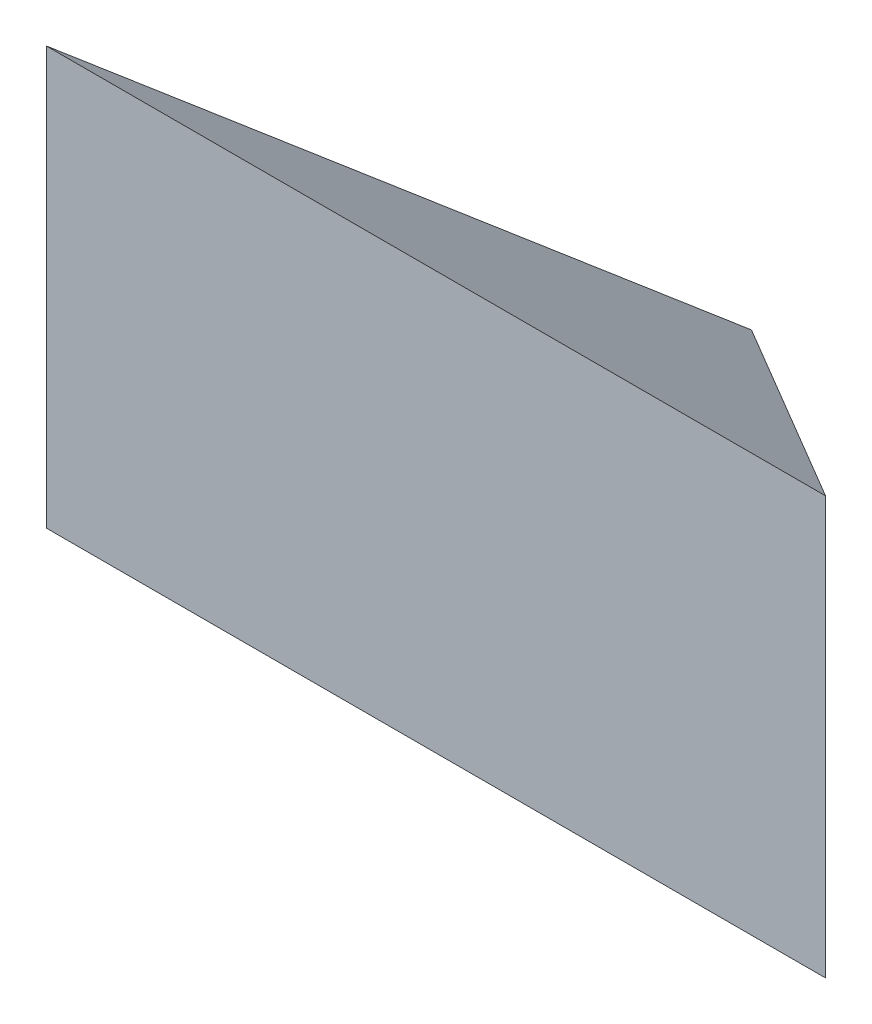
ISO-10303-21;
HEADER;
FILE_DESCRIPTION(('STEP AP214'),'2;1');
FILE_NAME('part.step','',(''),(''),'','','');
FILE_SCHEMA(('AUTOMOTIVE_DESIGN { 1 0 10303 214 1 1 1 1 }'));
ENDSEC;
DATA;
#1=APPLICATION_CONTEXT('core data for automotive mechanical design processes');
#2=APPLICATION_PROTOCOL_DEFINITION('international standard','automotive_design',2000,#1);
#3=PRODUCT_CONTEXT('',#1,'mechanical');
#4=PRODUCT('Part','Part','',(#3));
#5=PRODUCT_RELATED_PRODUCT_CATEGORY('part','',(#4));
#6=PRODUCT_DEFINITION_FORMATION('','',#4);
#7=PRODUCT_DEFINITION_CONTEXT('part definition',#1,'design');
#8=PRODUCT_DEFINITION('design','',#6,#7);
#9=PRODUCT_DEFINITION_SHAPE('','',#8);
#10=(LENGTH_UNIT() NAMED_UNIT(*) SI_UNIT(.MILLI.,.METRE.));
#11=(NAMED_UNIT(*) PLANE_ANGLE_UNIT() SI_UNIT($,.RADIAN.));
#12=(NAMED_UNIT(*) SI_UNIT($,.STERADIAN.) SOLID_ANGLE_UNIT());
#13=UNCERTAINTY_MEASURE_WITH_UNIT(LENGTH_MEASURE(1.E-05),#10,'distance_accuracy_value','');
#14=(GEOMETRIC_REPRESENTATION_CONTEXT(3) GLOBAL_UNCERTAINTY_ASSIGNED_CONTEXT((#13)) GLOBAL_UNIT_ASSIGNED_CONTEXT((#10,
#11,#12)) REPRESENTATION_CONTEXT('',''));
#15=CARTESIAN_POINT('',(0.,0.,0.));
#16=DIRECTION('',(0.,0.,1.));
#17=DIRECTION('',(1.,0.,0.));
#18=AXIS2_PLACEMENT_3D('',#15,#16,#17);
#19=CARTESIAN_POINT('',(0.,0.,-48.2982044626187));
#20=DIRECTION('',(0.,0.,1.));
#21=DIRECTION('',(1.,0.,0.));
#22=AXIS2_PLACEMENT_3D('',#19,#20,#21);
#23=PLANE('',#22);
#24=DIRECTION('',(1.,0.,0.));
#25=VECTOR('',#24,1.);
#26=CARTESIAN_POINT('',(-103.731361148945,50.2996980242265,-48.2982044626186));
#27=LINE('',#26,#25);
#28=CARTESIAN_POINT('',(-103.731361148945,50.2996980242265,-48.2982044626186));
#29=VERTEX_POINT('',#28);
#30=CARTESIAN_POINT('',(103.731361148945,50.2996980242265,-48.2982044626186));
#31=VERTEX_POINT('',#30);
#32=EDGE_CURVE('E115',#29,#31,#27,.T.);
#33=ORIENTED_EDGE('',*,*,#32,.F.);
#34=DIRECTION('',(0.,-1.,0.));
#35=VECTOR('',#34,1.);
#36=CARTESIAN_POINT('',(-103.731361148945,50.2996980242265,-48.2982044626186));
#37=LINE('',#36,#35);
#38=CARTESIAN_POINT('',(-103.731361148945,-60.8970762566492,-48.2982044626186));
#39=VERTEX_POINT('',#38);
#40=EDGE_CURVE('E100',#29,#39,#37,.T.);
#41=ORIENTED_EDGE('',*,*,#40,.T.);
#42=DIRECTION('',(1.,0.,0.));
#43=VECTOR('',#42,1.);
#44=CARTESIAN_POINT('',(-103.731361148945,-60.8970762566492,-48.2982044626187));
#45=LINE('',#44,#43);
#46=CARTESIAN_POINT('',(103.731361148945,-60.8970762566491,-48.2982044626186));
#47=VERTEX_POINT('',#46);
#48=EDGE_CURVE('E109',#39,#47,#45,.T.);
#49=ORIENTED_EDGE('',*,*,#48,.T.);
#50=DIRECTION('',(0.,-1.,0.));
#51=VECTOR('',#50,1.);
#52=CARTESIAN_POINT('',(103.731361148945,50.2996980242265,-48.2982044626186));
#53=LINE('',#52,#51);
#54=EDGE_CURVE('E90',#31,#47,#53,.T.);
#55=ORIENTED_EDGE('',*,*,#54,.F.);
#56=EDGE_LOOP('',(#33,#41,#49,#55));
#57=FACE_BOUND('',#56,.T.);
#58=ADVANCED_FACE('F72',(#57),#23,.T.);
#59=CARTESIAN_POINT('',(103.731464226585,50.2996980242265,-48.2982044626186));
#60=DIRECTION('',(0.,-0.833885822067169,0.551936985312056));
#61=DIRECTION('',(0.,-0.551936985312056,-0.833885822067169));
#62=AXIS2_PLACEMENT_3D('',#59,#60,#61);
#63=PLANE('',#62);
#64=ORIENTED_EDGE('',*,*,#32,.T.);
#65=DIRECTION('',(-0.717398249241566,-0.38451424095297,-0.58093764767787));
#66=VECTOR('',#65,1.);
#67=CARTESIAN_POINT('',(103.731414198909,50.2997264581776,-48.2981615036047));
#68=LINE('',#67,#66);
#69=CARTESIAN_POINT('',(0.,-5.29868911621133,-132.298204462619));
#70=VERTEX_POINT('',#69);
#71=EDGE_CURVE('E116',#31,#70,#68,.T.);
#72=ORIENTED_EDGE('',*,*,#71,.T.);
#73=DIRECTION('',(-0.717398249241566,0.38451424095297,0.58093764767787));
#74=VECTOR('',#73,1.);
#75=CARTESIAN_POINT('',(3.04150801269008,-6.9288898395729,-134.76116908813));
#76=LINE('',#75,#74);
#77=EDGE_CURVE('E103',#70,#29,#76,.T.);
#78=ORIENTED_EDGE('',*,*,#77,.T.);
#79=EDGE_LOOP('',(#64,#72,#78));
#80=FACE_BOUND('',#79,.T.);
#81=ADVANCED_FACE('F114',(#80),#63,.F.);
#82=CARTESIAN_POINT('',(103.731464226586,-5.2986891162113,-132.298204462619));
#83=DIRECTION('',(0.,0.83388582206717,0.551936985312056));
#84=DIRECTION('',(0.,-0.551936985312056,0.83388582206717));
#85=AXIS2_PLACEMENT_3D('',#82,#83,#84);
#86=PLANE('',#85);
#87=DIRECTION('',(0.717398249241566,0.38451424095297,-0.58093764767787));
#88=VECTOR('',#87,1.);
#89=CARTESIAN_POINT('',(53.3864611057995,23.3156190326639,-175.529708254881));
#90=LINE('',#89,#88);
#91=EDGE_CURVE('E80',#39,#70,#90,.T.);
#92=ORIENTED_EDGE('',*,*,#91,.T.);
#93=DIRECTION('',(0.717398249241566,-0.38451424095297,0.58093764767787));
#94=VECTOR('',#93,1.);
#95=CARTESIAN_POINT('',(53.3864611057995,-33.9129972650865,-89.0667006703561));
#96=LINE('',#95,#94);
#97=EDGE_CURVE('E12',#70,#47,#96,.T.);
#98=ORIENTED_EDGE('',*,*,#97,.T.);
#99=ORIENTED_EDGE('',*,*,#48,.F.);
#100=EDGE_LOOP('',(#92,#98,#99));
#101=FACE_BOUND('',#100,.T.);
#102=ADVANCED_FACE('F137',(#101),#86,.F.);
#103=CARTESIAN_POINT('',(-103.731361148945,-60.8971793342899,-48.2982044626186));
#104=DIRECTION('',(0.629320391049836,0.,0.777145961456972));
#105=DIRECTION('',(0.777145961456972,0.,-0.629320391049836));
#106=AXIS2_PLACEMENT_3D('',#103,#104,#105);
#107=PLANE('',#106);
#108=ORIENTED_EDGE('',*,*,#91,.F.);
#109=ORIENTED_EDGE('',*,*,#40,.F.);
#110=ORIENTED_EDGE('',*,*,#77,.F.);
#111=EDGE_LOOP('',(#108,#109,#110));
#112=FACE_BOUND('',#111,.T.);
#113=ADVANCED_FACE('F102',(#112),#107,.F.);
#114=CARTESIAN_POINT('',(0.,-60.8971793342899,-132.298204462619));
#115=DIRECTION('',(-0.629320391049836,0.,0.777145961456972));
#116=DIRECTION('',(0.777145961456972,0.,0.629320391049836));
#117=AXIS2_PLACEMENT_3D('',#114,#115,#116);
#118=PLANE('',#117);
#119=ORIENTED_EDGE('',*,*,#54,.T.);
#120=ORIENTED_EDGE('',*,*,#97,.F.);
#121=ORIENTED_EDGE('',*,*,#71,.F.);
#122=EDGE_LOOP('',(#119,#120,#121));
#123=FACE_BOUND('',#122,.T.);
#124=ADVANCED_FACE('F143',(#123),#118,.F.);
#125=CLOSED_SHELL('',(#58,#81,#102,#113,#124));
#126=MANIFOLD_SOLID_BREP('B2',#125);
#127=ADVANCED_BREP_SHAPE_REPRESENTATION('',(#18,#126),#14);
#128=SHAPE_DEFINITION_REPRESENTATION(#9,#127);
ENDSEC;
END-ISO-10303-21;
